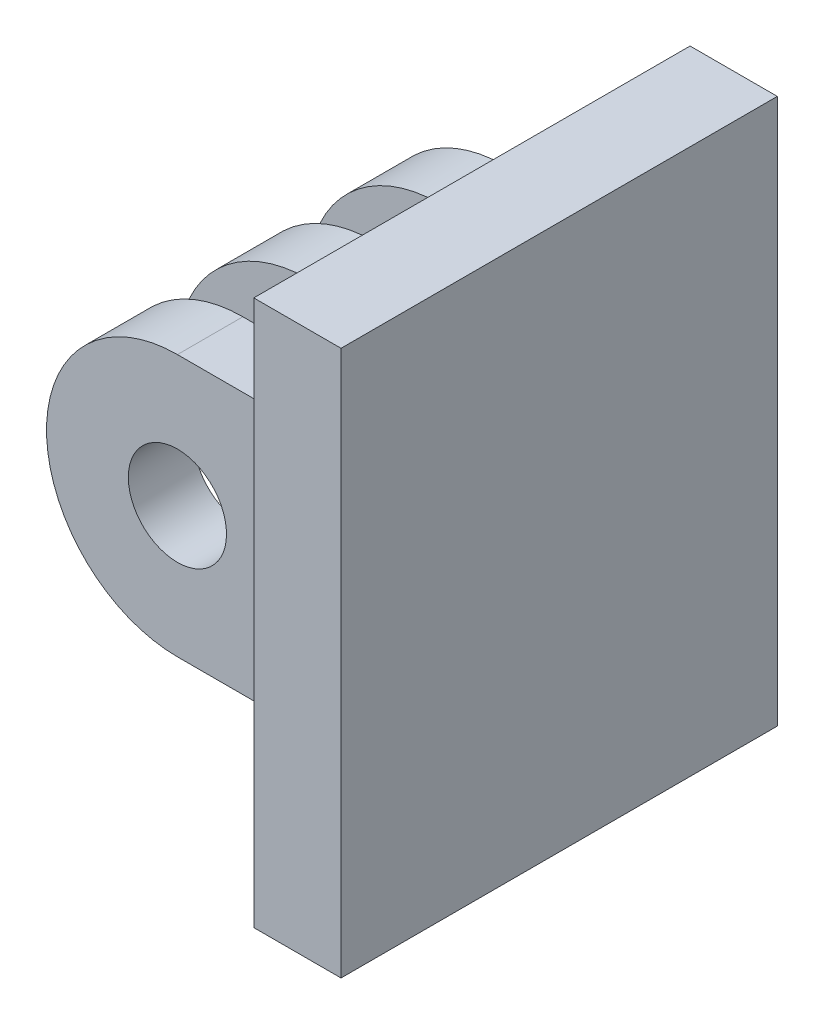
ISO-10303-21;
HEADER;
FILE_DESCRIPTION(('STEP AP214'),'2;1');
FILE_NAME('part.step','',(''),(''),'','','');
FILE_SCHEMA(('AUTOMOTIVE_DESIGN { 1 0 10303 214 1 1 1 1 }'));
ENDSEC;
DATA;
#1=APPLICATION_CONTEXT('core data for automotive mechanical design processes');
#2=APPLICATION_PROTOCOL_DEFINITION('international standard','automotive_design',2000,#1);
#3=PRODUCT_CONTEXT('',#1,'mechanical');
#4=PRODUCT('Part','Part','',(#3));
#5=PRODUCT_RELATED_PRODUCT_CATEGORY('part','',(#4));
#6=PRODUCT_DEFINITION_FORMATION('','',#4);
#7=PRODUCT_DEFINITION_CONTEXT('part definition',#1,'design');
#8=PRODUCT_DEFINITION('design','',#6,#7);
#9=PRODUCT_DEFINITION_SHAPE('','',#8);
#10=(LENGTH_UNIT() NAMED_UNIT(*) SI_UNIT(.MILLI.,.METRE.));
#11=(NAMED_UNIT(*) PLANE_ANGLE_UNIT() SI_UNIT($,.RADIAN.));
#12=(NAMED_UNIT(*) SI_UNIT($,.STERADIAN.) SOLID_ANGLE_UNIT());
#13=UNCERTAINTY_MEASURE_WITH_UNIT(LENGTH_MEASURE(1.E-05),#10,'distance_accuracy_value','');
#14=(GEOMETRIC_REPRESENTATION_CONTEXT(3) GLOBAL_UNCERTAINTY_ASSIGNED_CONTEXT((#13)) GLOBAL_UNIT_ASSIGNED_CONTEXT((#10,
#11,#12)) REPRESENTATION_CONTEXT('',''));
#15=CARTESIAN_POINT('',(0.,0.,0.));
#16=DIRECTION('',(0.,0.,1.));
#17=DIRECTION('',(1.,0.,0.));
#18=AXIS2_PLACEMENT_3D('',#15,#16,#17);
#19=CARTESIAN_POINT('',(-12.,-18.5,-11.5));
#20=DIRECTION('',(0.,0.,1.));
#21=DIRECTION('',(1.,0.,0.));
#22=AXIS2_PLACEMENT_3D('',#19,#20,#21);
#23=PLANE('',#22);
#24=CARTESIAN_POINT('',(-6.,-12.5,-11.5));
#25=DIRECTION('',(0.,0.,1.));
#26=DIRECTION('',(1.,0.,0.));
#27=AXIS2_PLACEMENT_3D('',#24,#25,#26);
#28=CIRCLE('',#27,2.25);
#29=CARTESIAN_POINT('',(-3.75,-12.5,-11.5));
#30=VERTEX_POINT('',#29);
#31=EDGE_CURVE('E345',#30,#30,#28,.T.);
#32=ORIENTED_EDGE('',*,*,#31,.T.);
#33=EDGE_LOOP('',(#32));
#34=FACE_BOUND('',#33,.T.);
#35=DIRECTION('',(1.,0.,0.));
#36=VECTOR('',#35,1.);
#37=CARTESIAN_POINT('',(-12.,-18.5,-11.5));
#38=LINE('',#37,#36);
#39=CARTESIAN_POINT('',(-6.,-18.5,-11.5));
#40=VERTEX_POINT('',#39);
#41=CARTESIAN_POINT('',(0.,-18.5,-11.5));
#42=VERTEX_POINT('',#41);
#43=EDGE_CURVE('E237',#40,#42,#38,.T.);
#44=ORIENTED_EDGE('',*,*,#43,.F.);
#45=CARTESIAN_POINT('',(-6.,-12.5,-11.5));
#46=DIRECTION('',(0.,0.,1.));
#47=DIRECTION('',(1.,0.,0.));
#48=AXIS2_PLACEMENT_3D('',#45,#46,#47);
#49=CIRCLE('',#48,6.);
#50=CARTESIAN_POINT('',(-6.,-6.50000000000001,-11.5));
#51=VERTEX_POINT('',#50);
#52=EDGE_CURVE('E363',#40,#51,#49,.F.);
#53=ORIENTED_EDGE('',*,*,#52,.T.);
#54=DIRECTION('',(1.,0.,0.));
#55=VECTOR('',#54,1.);
#56=CARTESIAN_POINT('',(-12.,-6.5,-11.5));
#57=LINE('',#56,#55);
#58=CARTESIAN_POINT('',(0.,-6.5,-11.5));
#59=VERTEX_POINT('',#58);
#60=EDGE_CURVE('E231',#51,#59,#57,.T.);
#61=ORIENTED_EDGE('',*,*,#60,.T.);
#62=DIRECTION('',(0.,-1.,0.));
#63=VECTOR('',#62,1.);
#64=CARTESIAN_POINT('',(0.,-18.5,-11.5));
#65=LINE('',#64,#63);
#66=EDGE_CURVE('E219',#59,#42,#65,.T.);
#67=ORIENTED_EDGE('',*,*,#66,.T.);
#68=EDGE_LOOP('',(#44,#53,#61,#67));
#69=FACE_BOUND('',#68,.T.);
#70=ADVANCED_FACE('F57',(#34,#69),#23,.F.);
#71=CARTESIAN_POINT('',(-12.,-18.5,-8.50000000000001));
#72=DIRECTION('',(0.,1.,0.));
#73=DIRECTION('',(0.,0.,1.));
#74=AXIS2_PLACEMENT_3D('',#71,#72,#73);
#75=PLANE('',#74);
#76=DIRECTION('',(0.,0.,-1.));
#77=VECTOR('',#76,1.);
#78=CARTESIAN_POINT('',(-6.,-18.5,0.));
#79=LINE('',#78,#77);
#80=CARTESIAN_POINT('',(-6.,-18.5,-8.50000000000001));
#81=VERTEX_POINT('',#80);
#82=EDGE_CURVE('E188',#81,#40,#79,.T.);
#83=ORIENTED_EDGE('',*,*,#82,.T.);
#84=ORIENTED_EDGE('',*,*,#43,.T.);
#85=DIRECTION('',(0.,0.,1.));
#86=VECTOR('',#85,1.);
#87=CARTESIAN_POINT('',(0.,-18.5,-8.50000000000001));
#88=LINE('',#87,#86);
#89=CARTESIAN_POINT('',(0.,-18.5,-8.50000000000001));
#90=VERTEX_POINT('',#89);
#91=EDGE_CURVE('E222',#42,#90,#88,.T.);
#92=ORIENTED_EDGE('',*,*,#91,.T.);
#93=DIRECTION('',(1.,0.,0.));
#94=VECTOR('',#93,1.);
#95=CARTESIAN_POINT('',(-12.,-18.5,-8.50000000000001));
#96=LINE('',#95,#94);
#97=EDGE_CURVE('E235',#81,#90,#96,.T.);
#98=ORIENTED_EDGE('',*,*,#97,.F.);
#99=EDGE_LOOP('',(#83,#84,#92,#98));
#100=FACE_BOUND('',#99,.T.);
#101=ADVANCED_FACE('F286',(#100),#75,.F.);
#102=CARTESIAN_POINT('',(-12.,-18.5,-8.50000000000001));
#103=DIRECTION('',(0.,0.,-1.));
#104=DIRECTION('',(-1.,0.,0.));
#105=AXIS2_PLACEMENT_3D('',#102,#103,#104);
#106=PLANE('',#105);
#107=CARTESIAN_POINT('',(-6.,-12.5,-8.50000000000001));
#108=DIRECTION('',(0.,0.,-1.));
#109=DIRECTION('',(-1.,0.,0.));
#110=AXIS2_PLACEMENT_3D('',#107,#108,#109);
#111=CIRCLE('',#110,2.25);
#112=CARTESIAN_POINT('',(-8.25,-12.5,-8.50000000000001));
#113=VERTEX_POINT('',#112);
#114=EDGE_CURVE('E351',#113,#113,#111,.T.);
#115=ORIENTED_EDGE('',*,*,#114,.T.);
#116=EDGE_LOOP('',(#115));
#117=FACE_BOUND('',#116,.T.);
#118=CARTESIAN_POINT('',(-6.,-12.5,-8.50000000000001));
#119=DIRECTION('',(0.,0.,-1.));
#120=DIRECTION('',(-1.,0.,0.));
#121=AXIS2_PLACEMENT_3D('',#118,#119,#120);
#122=CIRCLE('',#121,6.);
#123=CARTESIAN_POINT('',(-6.,-6.50000000000001,-8.50000000000001));
#124=VERTEX_POINT('',#123);
#125=EDGE_CURVE('E366',#124,#81,#122,.F.);
#126=ORIENTED_EDGE('',*,*,#125,.T.);
#127=ORIENTED_EDGE('',*,*,#97,.T.);
#128=DIRECTION('',(0.,1.,0.));
#129=VECTOR('',#128,1.);
#130=CARTESIAN_POINT('',(0.,-18.5,-8.50000000000001));
#131=LINE('',#130,#129);
#132=CARTESIAN_POINT('',(0.,-6.5,-8.50000000000001));
#133=VERTEX_POINT('',#132);
#134=EDGE_CURVE('E225',#90,#133,#131,.T.);
#135=ORIENTED_EDGE('',*,*,#134,.T.);
#136=DIRECTION('',(1.,0.,0.));
#137=VECTOR('',#136,1.);
#138=CARTESIAN_POINT('',(-12.,-6.5,-8.50000000000001));
#139=LINE('',#138,#137);
#140=EDGE_CURVE('E233',#124,#133,#139,.T.);
#141=ORIENTED_EDGE('',*,*,#140,.F.);
#142=EDGE_LOOP('',(#126,#127,#135,#141));
#143=FACE_BOUND('',#142,.T.);
#144=ADVANCED_FACE('F292',(#117,#143),#106,.F.);
#145=CARTESIAN_POINT('',(-12.,-6.5,-2.5));
#146=DIRECTION('',(0.,0.,-1.));
#147=DIRECTION('',(0.,1.,0.));
#148=AXIS2_PLACEMENT_3D('',#145,#146,#147);
#149=PLANE('',#148);
#150=CARTESIAN_POINT('',(-6.,-12.5,-2.5));
#151=DIRECTION('',(0.,0.,-1.));
#152=DIRECTION('',(0.,1.,0.));
#153=AXIS2_PLACEMENT_3D('',#150,#151,#152);
#154=CIRCLE('',#153,2.25);
#155=CARTESIAN_POINT('',(-6.,-10.25,-2.5));
#156=VERTEX_POINT('',#155);
#157=EDGE_CURVE('E354',#156,#156,#154,.T.);
#158=ORIENTED_EDGE('',*,*,#157,.T.);
#159=EDGE_LOOP('',(#158));
#160=FACE_BOUND('',#159,.T.);
#161=CARTESIAN_POINT('',(-6.,-12.5,-2.5));
#162=DIRECTION('',(0.,0.,-1.));
#163=DIRECTION('',(0.,1.,0.));
#164=AXIS2_PLACEMENT_3D('',#161,#162,#163);
#165=CIRCLE('',#164,6.);
#166=CARTESIAN_POINT('',(-6.,-6.50000000000001,-2.5));
#167=VERTEX_POINT('',#166);
#168=CARTESIAN_POINT('',(-6.,-18.5,-2.5));
#169=VERTEX_POINT('',#168);
#170=EDGE_CURVE('E368',#167,#169,#165,.F.);
#171=ORIENTED_EDGE('',*,*,#170,.T.);
#172=DIRECTION('',(1.,0.,0.));
#173=VECTOR('',#172,1.);
#174=CARTESIAN_POINT('',(-12.,-18.5,-2.5));
#175=LINE('',#174,#173);
#176=CARTESIAN_POINT('',(0.,-18.5,-2.5));
#177=VERTEX_POINT('',#176);
#178=EDGE_CURVE('E211',#169,#177,#175,.T.);
#179=ORIENTED_EDGE('',*,*,#178,.T.);
#180=DIRECTION('',(0.,1.,0.));
#181=VECTOR('',#180,1.);
#182=CARTESIAN_POINT('',(0.,-6.5,-2.5));
#183=LINE('',#182,#181);
#184=CARTESIAN_POINT('',(0.,-6.5,-2.5));
#185=VERTEX_POINT('',#184);
#186=EDGE_CURVE('E199',#177,#185,#183,.T.);
#187=ORIENTED_EDGE('',*,*,#186,.T.);
#188=DIRECTION('',(1.,0.,0.));
#189=VECTOR('',#188,1.);
#190=CARTESIAN_POINT('',(-12.,-6.5,-2.5));
#191=LINE('',#190,#189);
#192=EDGE_CURVE('E217',#167,#185,#191,.T.);
#193=ORIENTED_EDGE('',*,*,#192,.F.);
#194=EDGE_LOOP('',(#171,#179,#187,#193));
#195=FACE_BOUND('',#194,.T.);
#196=ADVANCED_FACE('F394',(#160,#195),#149,.F.);
#197=CARTESIAN_POINT('',(-12.,-6.5,-5.5));
#198=DIRECTION('',(0.,0.,1.));
#199=DIRECTION('',(0.,-1.,0.));
#200=AXIS2_PLACEMENT_3D('',#197,#198,#199);
#201=PLANE('',#200);
#202=CARTESIAN_POINT('',(-6.,-12.5,-5.5));
#203=DIRECTION('',(0.,0.,1.));
#204=DIRECTION('',(0.,-1.,0.));
#205=AXIS2_PLACEMENT_3D('',#202,#203,#204);
#206=CIRCLE('',#205,2.25);
#207=CARTESIAN_POINT('',(-6.,-14.75,-5.5));
#208=VERTEX_POINT('',#207);
#209=EDGE_CURVE('E357',#208,#208,#206,.T.);
#210=ORIENTED_EDGE('',*,*,#209,.T.);
#211=EDGE_LOOP('',(#210));
#212=FACE_BOUND('',#211,.T.);
#213=DIRECTION('',(1.,0.,0.));
#214=VECTOR('',#213,1.);
#215=CARTESIAN_POINT('',(-12.,-18.5,-5.5));
#216=LINE('',#215,#214);
#217=CARTESIAN_POINT('',(-6.,-18.5,-5.5));
#218=VERTEX_POINT('',#217);
#219=CARTESIAN_POINT('',(0.,-18.5,-5.5));
#220=VERTEX_POINT('',#219);
#221=EDGE_CURVE('E213',#218,#220,#216,.T.);
#222=ORIENTED_EDGE('',*,*,#221,.F.);
#223=CARTESIAN_POINT('',(-6.,-12.5,-5.5));
#224=DIRECTION('',(0.,0.,1.));
#225=DIRECTION('',(0.,-1.,0.));
#226=AXIS2_PLACEMENT_3D('',#223,#224,#225);
#227=CIRCLE('',#226,6.);
#228=CARTESIAN_POINT('',(-6.,-6.50000000000001,-5.5));
#229=VERTEX_POINT('',#228);
#230=EDGE_CURVE('E370',#218,#229,#227,.F.);
#231=ORIENTED_EDGE('',*,*,#230,.T.);
#232=DIRECTION('',(1.,0.,0.));
#233=VECTOR('',#232,1.);
#234=CARTESIAN_POINT('',(-12.,-6.5,-5.5));
#235=LINE('',#234,#233);
#236=CARTESIAN_POINT('',(0.,-6.5,-5.5));
#237=VERTEX_POINT('',#236);
#238=EDGE_CURVE('E215',#229,#237,#235,.T.);
#239=ORIENTED_EDGE('',*,*,#238,.T.);
#240=DIRECTION('',(0.,-1.,0.));
#241=VECTOR('',#240,1.);
#242=CARTESIAN_POINT('',(0.,-6.5,-5.5));
#243=LINE('',#242,#241);
#244=EDGE_CURVE('E205',#237,#220,#243,.T.);
#245=ORIENTED_EDGE('',*,*,#244,.T.);
#246=EDGE_LOOP('',(#222,#231,#239,#245));
#247=FACE_BOUND('',#246,.T.);
#248=ADVANCED_FACE('F387',(#212,#247),#201,.F.);
#249=CARTESIAN_POINT('',(-12.,-18.5,-5.5));
#250=DIRECTION('',(0.,1.,0.));
#251=DIRECTION('',(0.,0.,1.));
#252=AXIS2_PLACEMENT_3D('',#249,#250,#251);
#253=PLANE('',#252);
#254=EDGE_CURVE('E180',#169,#218,#79,.T.);
#255=ORIENTED_EDGE('',*,*,#254,.T.);
#256=ORIENTED_EDGE('',*,*,#221,.T.);
#257=DIRECTION('',(0.,0.,1.));
#258=VECTOR('',#257,1.);
#259=CARTESIAN_POINT('',(0.,-18.5,-5.5));
#260=LINE('',#259,#258);
#261=EDGE_CURVE('E208',#220,#177,#260,.T.);
#262=ORIENTED_EDGE('',*,*,#261,.T.);
#263=ORIENTED_EDGE('',*,*,#178,.F.);
#264=EDGE_LOOP('',(#255,#256,#262,#263));
#265=FACE_BOUND('',#264,.T.);
#266=ADVANCED_FACE('F397',(#265),#253,.F.);
#267=CARTESIAN_POINT('',(-12.,-6.50000000000001,-14.5));
#268=DIRECTION('',(0.,0.,-1.));
#269=DIRECTION('',(0.,1.,0.));
#270=AXIS2_PLACEMENT_3D('',#267,#268,#269);
#271=PLANE('',#270);
#272=CARTESIAN_POINT('',(-6.,-12.5,-14.5));
#273=DIRECTION('',(0.,0.,-1.));
#274=DIRECTION('',(0.,1.,0.));
#275=AXIS2_PLACEMENT_3D('',#272,#273,#274);
#276=CIRCLE('',#275,2.25);
#277=CARTESIAN_POINT('',(-6.,-10.25,-14.5));
#278=VERTEX_POINT('',#277);
#279=EDGE_CURVE('E360',#278,#278,#276,.T.);
#280=ORIENTED_EDGE('',*,*,#279,.T.);
#281=EDGE_LOOP('',(#280));
#282=FACE_BOUND('',#281,.T.);
#283=CARTESIAN_POINT('',(-6.,-12.5,-14.5));
#284=DIRECTION('',(0.,0.,-1.));
#285=DIRECTION('',(0.,1.,0.));
#286=AXIS2_PLACEMENT_3D('',#283,#284,#285);
#287=CIRCLE('',#286,6.);
#288=CARTESIAN_POINT('',(-6.,-6.50000000000001,-14.5));
#289=VERTEX_POINT('',#288);
#290=CARTESIAN_POINT('',(-6.,-18.5,-14.5));
#291=VERTEX_POINT('',#290);
#292=EDGE_CURVE('E373',#289,#291,#287,.F.);
#293=ORIENTED_EDGE('',*,*,#292,.T.);
#294=DIRECTION('',(1.,0.,0.));
#295=VECTOR('',#294,1.);
#296=CARTESIAN_POINT('',(-12.,-18.5,-14.5));
#297=LINE('',#296,#295);
#298=CARTESIAN_POINT('',(0.,-18.5,-14.5));
#299=VERTEX_POINT('',#298);
#300=EDGE_CURVE('E187',#291,#299,#297,.T.);
#301=ORIENTED_EDGE('',*,*,#300,.T.);
#302=DIRECTION('',(0.,1.,0.));
#303=VECTOR('',#302,1.);
#304=CARTESIAN_POINT('',(0.,-6.50000000000001,-14.5));
#305=LINE('',#304,#303);
#306=CARTESIAN_POINT('',(0.,-6.50000000000001,-14.5));
#307=VERTEX_POINT('',#306);
#308=EDGE_CURVE('E342',#299,#307,#305,.T.);
#309=ORIENTED_EDGE('',*,*,#308,.T.);
#310=DIRECTION('',(1.,0.,0.));
#311=VECTOR('',#310,1.);
#312=CARTESIAN_POINT('',(-12.,-6.50000000000001,-14.5));
#313=LINE('',#312,#311);
#314=EDGE_CURVE('E72',#289,#307,#313,.T.);
#315=ORIENTED_EDGE('',*,*,#314,.F.);
#316=EDGE_LOOP('',(#293,#301,#309,#315));
#317=FACE_BOUND('',#316,.T.);
#318=ADVANCED_FACE('F431',(#282,#317),#271,.F.);
#319=CARTESIAN_POINT('',(-12.,-6.50000000000001,-17.5));
#320=DIRECTION('',(0.,0.,1.));
#321=DIRECTION('',(1.,0.,0.));
#322=AXIS2_PLACEMENT_3D('',#319,#320,#321);
#323=PLANE('',#322);
#324=CARTESIAN_POINT('',(-6.,-12.5,-17.5));
#325=DIRECTION('',(0.,0.,1.));
#326=DIRECTION('',(1.,0.,0.));
#327=AXIS2_PLACEMENT_3D('',#324,#325,#326);
#328=CIRCLE('',#327,3.);
#329=CARTESIAN_POINT('',(-3.,-12.5,-17.5));
#330=VERTEX_POINT('',#329);
#331=EDGE_CURVE('E12',#330,#330,#328,.T.);
#332=ORIENTED_EDGE('',*,*,#331,.T.);
#333=EDGE_LOOP('',(#332));
#334=FACE_BOUND('',#333,.T.);
#335=DIRECTION('',(1.,0.,0.));
#336=VECTOR('',#335,1.);
#337=CARTESIAN_POINT('',(-12.,-18.5,-17.5));
#338=LINE('',#337,#336);
#339=CARTESIAN_POINT('',(-6.,-18.5,-17.5));
#340=VERTEX_POINT('',#339);
#341=CARTESIAN_POINT('',(0.,-18.5,-17.5));
#342=VERTEX_POINT('',#341);
#343=EDGE_CURVE('E185',#340,#342,#338,.T.);
#344=ORIENTED_EDGE('',*,*,#343,.F.);
#345=CARTESIAN_POINT('',(-6.,-12.5,-17.5));
#346=DIRECTION('',(0.,0.,-1.));
#347=DIRECTION('',(-1.,0.,0.));
#348=AXIS2_PLACEMENT_3D('',#345,#346,#347);
#349=CIRCLE('',#348,6.);
#350=CARTESIAN_POINT('',(-6.,-6.50000000000001,-17.5));
#351=VERTEX_POINT('',#350);
#352=EDGE_CURVE('E173',#351,#340,#349,.F.);
#353=ORIENTED_EDGE('',*,*,#352,.F.);
#354=DIRECTION('',(1.,0.,0.));
#355=VECTOR('',#354,1.);
#356=CARTESIAN_POINT('',(-12.,-6.50000000000001,-17.5));
#357=LINE('',#356,#355);
#358=CARTESIAN_POINT('',(0.,-6.50000000000001,-17.5));
#359=VERTEX_POINT('',#358);
#360=EDGE_CURVE('E80',#351,#359,#357,.T.);
#361=ORIENTED_EDGE('',*,*,#360,.T.);
#362=DIRECTION('',(0.,-1.,0.));
#363=VECTOR('',#362,1.);
#364=CARTESIAN_POINT('',(0.,-6.50000000000001,-17.5));
#365=LINE('',#364,#363);
#366=EDGE_CURVE('E191',#359,#342,#365,.T.);
#367=ORIENTED_EDGE('',*,*,#366,.T.);
#368=EDGE_LOOP('',(#344,#353,#361,#367));
#369=FACE_BOUND('',#368,.T.);
#370=ADVANCED_FACE('F190',(#334,#369),#323,.F.);
#371=CARTESIAN_POINT('',(-12.,-18.5,-17.5));
#372=DIRECTION('',(0.,1.,0.));
#373=DIRECTION('',(0.,0.,1.));
#374=AXIS2_PLACEMENT_3D('',#371,#372,#373);
#375=PLANE('',#374);
#376=EDGE_CURVE('E176',#291,#340,#79,.T.);
#377=ORIENTED_EDGE('',*,*,#376,.T.);
#378=ORIENTED_EDGE('',*,*,#343,.T.);
#379=DIRECTION('',(0.,0.,1.));
#380=VECTOR('',#379,1.);
#381=CARTESIAN_POINT('',(0.,-18.5,-17.5));
#382=LINE('',#381,#380);
#383=EDGE_CURVE('E194',#342,#299,#382,.T.);
#384=ORIENTED_EDGE('',*,*,#383,.T.);
#385=ORIENTED_EDGE('',*,*,#300,.F.);
#386=EDGE_LOOP('',(#377,#378,#384,#385));
#387=FACE_BOUND('',#386,.T.);
#388=ADVANCED_FACE('F183',(#387),#375,.F.);
#389=CARTESIAN_POINT('',(0.,0.,0.));
#390=DIRECTION('',(1.,0.,0.));
#391=DIRECTION('',(0.,0.,-1.));
#392=AXIS2_PLACEMENT_3D('',#389,#390,#391);
#393=PLANE('',#392);
#394=ORIENTED_EDGE('',*,*,#186,.F.);
#395=ORIENTED_EDGE('',*,*,#261,.F.);
#396=ORIENTED_EDGE('',*,*,#244,.F.);
#397=DIRECTION('',(0.,0.,-1.));
#398=VECTOR('',#397,1.);
#399=CARTESIAN_POINT('',(0.,-6.5,-5.5));
#400=LINE('',#399,#398);
#401=EDGE_CURVE('E202',#185,#237,#400,.T.);
#402=ORIENTED_EDGE('',*,*,#401,.F.);
#403=EDGE_LOOP('',(#394,#395,#396,#402));
#404=FACE_BOUND('',#403,.T.);
#405=DIRECTION('',(0.,-1.,0.));
#406=VECTOR('',#405,1.);
#407=CARTESIAN_POINT('',(0.,0.,0.));
#408=LINE('',#407,#406);
#409=CARTESIAN_POINT('',(0.,0.,0.));
#410=VERTEX_POINT('',#409);
#411=CARTESIAN_POINT('',(0.,-25.,0.));
#412=VERTEX_POINT('',#411);
#413=EDGE_CURVE('E239',#410,#412,#408,.T.);
#414=ORIENTED_EDGE('',*,*,#413,.F.);
#415=DIRECTION('',(0.,0.,1.));
#416=VECTOR('',#415,1.);
#417=CARTESIAN_POINT('',(0.,0.,0.));
#418=LINE('',#417,#416);
#419=CARTESIAN_POINT('',(0.,0.,-20.));
#420=VERTEX_POINT('',#419);
#421=EDGE_CURVE('E244',#420,#410,#418,.T.);
#422=ORIENTED_EDGE('',*,*,#421,.F.);
#423=DIRECTION('',(0.,1.,0.));
#424=VECTOR('',#423,1.);
#425=CARTESIAN_POINT('',(0.,0.,-20.));
#426=LINE('',#425,#424);
#427=CARTESIAN_POINT('',(0.,-25.,-20.));
#428=VERTEX_POINT('',#427);
#429=EDGE_CURVE('E255',#428,#420,#426,.T.);
#430=ORIENTED_EDGE('',*,*,#429,.F.);
#431=DIRECTION('',(0.,0.,-1.));
#432=VECTOR('',#431,1.);
#433=CARTESIAN_POINT('',(0.,-25.,0.));
#434=LINE('',#433,#432);
#435=EDGE_CURVE('E253',#412,#428,#434,.T.);
#436=ORIENTED_EDGE('',*,*,#435,.F.);
#437=EDGE_LOOP('',(#414,#422,#430,#436));
#438=FACE_BOUND('',#437,.T.);
#439=ORIENTED_EDGE('',*,*,#66,.F.);
#440=DIRECTION('',(0.,0.,-1.));
#441=VECTOR('',#440,1.);
#442=CARTESIAN_POINT('',(0.,-6.5,-8.50000000000001));
#443=LINE('',#442,#441);
#444=EDGE_CURVE('E228',#133,#59,#443,.T.);
#445=ORIENTED_EDGE('',*,*,#444,.F.);
#446=ORIENTED_EDGE('',*,*,#134,.F.);
#447=ORIENTED_EDGE('',*,*,#91,.F.);
#448=EDGE_LOOP('',(#439,#445,#446,#447));
#449=FACE_BOUND('',#448,.T.);
#450=ORIENTED_EDGE('',*,*,#308,.F.);
#451=ORIENTED_EDGE('',*,*,#383,.F.);
#452=ORIENTED_EDGE('',*,*,#366,.F.);
#453=DIRECTION('',(0.,0.,-1.));
#454=VECTOR('',#453,1.);
#455=CARTESIAN_POINT('',(0.,-6.50000000000001,-17.5));
#456=LINE('',#455,#454);
#457=EDGE_CURVE('E343',#307,#359,#456,.T.);
#458=ORIENTED_EDGE('',*,*,#457,.F.);
#459=EDGE_LOOP('',(#450,#451,#452,#458));
#460=FACE_BOUND('',#459,.T.);
#461=ADVANCED_FACE('F305',(#404,#438,#449,#460),#393,.F.);
#462=CARTESIAN_POINT('',(4.,0.,0.));
#463=DIRECTION('',(0.,0.,-1.));
#464=DIRECTION('',(0.,1.,0.));
#465=AXIS2_PLACEMENT_3D('',#462,#463,#464);
#466=PLANE('',#465);
#467=ORIENTED_EDGE('',*,*,#413,.T.);
#468=DIRECTION('',(-1.,0.,0.));
#469=VECTOR('',#468,1.);
#470=CARTESIAN_POINT('',(4.,-25.,0.));
#471=LINE('',#470,#469);
#472=CARTESIAN_POINT('',(4.,-25.,0.));
#473=VERTEX_POINT('',#472);
#474=EDGE_CURVE('E266',#473,#412,#471,.T.);
#475=ORIENTED_EDGE('',*,*,#474,.F.);
#476=DIRECTION('',(0.,-1.,0.));
#477=VECTOR('',#476,1.);
#478=CARTESIAN_POINT('',(4.,0.,0.));
#479=LINE('',#478,#477);
#480=CARTESIAN_POINT('',(4.,0.,0.));
#481=VERTEX_POINT('',#480);
#482=EDGE_CURVE('E240',#481,#473,#479,.T.);
#483=ORIENTED_EDGE('',*,*,#482,.F.);
#484=DIRECTION('',(-1.,0.,0.));
#485=VECTOR('',#484,1.);
#486=CARTESIAN_POINT('',(4.,0.,0.));
#487=LINE('',#486,#485);
#488=EDGE_CURVE('E250',#481,#410,#487,.T.);
#489=ORIENTED_EDGE('',*,*,#488,.T.);
#490=EDGE_LOOP('',(#467,#475,#483,#489));
#491=FACE_BOUND('',#490,.T.);
#492=ADVANCED_FACE('F308',(#491),#466,.F.);
#493=CARTESIAN_POINT('',(4.,-25.,0.));
#494=DIRECTION('',(0.,1.,0.));
#495=DIRECTION('',(0.,0.,1.));
#496=AXIS2_PLACEMENT_3D('',#493,#494,#495);
#497=PLANE('',#496);
#498=ORIENTED_EDGE('',*,*,#435,.T.);
#499=DIRECTION('',(-1.,0.,0.));
#500=VECTOR('',#499,1.);
#501=CARTESIAN_POINT('',(4.,-25.,-20.));
#502=LINE('',#501,#500);
#503=CARTESIAN_POINT('',(4.,-25.,-20.));
#504=VERTEX_POINT('',#503);
#505=EDGE_CURVE('E263',#504,#428,#502,.T.);
#506=ORIENTED_EDGE('',*,*,#505,.F.);
#507=DIRECTION('',(0.,0.,-1.));
#508=VECTOR('',#507,1.);
#509=CARTESIAN_POINT('',(4.,-25.,0.));
#510=LINE('',#509,#508);
#511=EDGE_CURVE('E243',#473,#504,#510,.T.);
#512=ORIENTED_EDGE('',*,*,#511,.F.);
#513=ORIENTED_EDGE('',*,*,#474,.T.);
#514=EDGE_LOOP('',(#498,#506,#512,#513));
#515=FACE_BOUND('',#514,.T.);
#516=ADVANCED_FACE('F316',(#515),#497,.F.);
#517=CARTESIAN_POINT('',(4.,0.,-20.));
#518=DIRECTION('',(0.,0.,1.));
#519=DIRECTION('',(0.,-1.,0.));
#520=AXIS2_PLACEMENT_3D('',#517,#518,#519);
#521=PLANE('',#520);
#522=ORIENTED_EDGE('',*,*,#429,.T.);
#523=DIRECTION('',(-1.,0.,0.));
#524=VECTOR('',#523,1.);
#525=CARTESIAN_POINT('',(4.,0.,-20.));
#526=LINE('',#525,#524);
#527=CARTESIAN_POINT('',(4.,0.,-20.));
#528=VERTEX_POINT('',#527);
#529=EDGE_CURVE('E260',#528,#420,#526,.T.);
#530=ORIENTED_EDGE('',*,*,#529,.F.);
#531=DIRECTION('',(0.,1.,0.));
#532=VECTOR('',#531,1.);
#533=CARTESIAN_POINT('',(4.,0.,-20.));
#534=LINE('',#533,#532);
#535=EDGE_CURVE('E246',#504,#528,#534,.T.);
#536=ORIENTED_EDGE('',*,*,#535,.F.);
#537=ORIENTED_EDGE('',*,*,#505,.T.);
#538=EDGE_LOOP('',(#522,#530,#536,#537));
#539=FACE_BOUND('',#538,.T.);
#540=ADVANCED_FACE('F312',(#539),#521,.F.);
#541=CARTESIAN_POINT('',(4.,0.,0.));
#542=DIRECTION('',(0.,-1.,0.));
#543=DIRECTION('',(0.,0.,-1.));
#544=AXIS2_PLACEMENT_3D('',#541,#542,#543);
#545=PLANE('',#544);
#546=ORIENTED_EDGE('',*,*,#421,.T.);
#547=ORIENTED_EDGE('',*,*,#488,.F.);
#548=DIRECTION('',(0.,0.,1.));
#549=VECTOR('',#548,1.);
#550=CARTESIAN_POINT('',(4.,0.,0.));
#551=LINE('',#550,#549);
#552=EDGE_CURVE('E248',#528,#481,#551,.T.);
#553=ORIENTED_EDGE('',*,*,#552,.F.);
#554=ORIENTED_EDGE('',*,*,#529,.T.);
#555=EDGE_LOOP('',(#546,#547,#553,#554));
#556=FACE_BOUND('',#555,.T.);
#557=ADVANCED_FACE('F303',(#556),#545,.F.);
#558=CARTESIAN_POINT('',(4.,0.,0.));
#559=DIRECTION('',(1.,0.,0.));
#560=DIRECTION('',(0.,0.,-1.));
#561=AXIS2_PLACEMENT_3D('',#558,#559,#560);
#562=PLANE('',#561);
#563=ORIENTED_EDGE('',*,*,#482,.T.);
#564=ORIENTED_EDGE('',*,*,#511,.T.);
#565=ORIENTED_EDGE('',*,*,#535,.T.);
#566=ORIENTED_EDGE('',*,*,#552,.T.);
#567=EDGE_LOOP('',(#563,#564,#565,#566));
#568=FACE_BOUND('',#567,.T.);
#569=ADVANCED_FACE('F299',(#568),#562,.T.);
#570=CARTESIAN_POINT('',(-12.,-6.5,-8.50000000000001));
#571=DIRECTION('',(0.,-1.,0.));
#572=DIRECTION('',(0.,0.,-1.));
#573=AXIS2_PLACEMENT_3D('',#570,#571,#572);
#574=PLANE('',#573);
#575=ORIENTED_EDGE('',*,*,#60,.F.);
#576=DIRECTION('',(0.,0.,-1.));
#577=VECTOR('',#576,1.);
#578=CARTESIAN_POINT('',(-6.,-6.50000000000001,0.));
#579=LINE('',#578,#577);
#580=EDGE_CURVE('E376',#124,#51,#579,.T.);
#581=ORIENTED_EDGE('',*,*,#580,.F.);
#582=ORIENTED_EDGE('',*,*,#140,.T.);
#583=ORIENTED_EDGE('',*,*,#444,.T.);
#584=EDGE_LOOP('',(#575,#581,#582,#583));
#585=FACE_BOUND('',#584,.T.);
#586=ADVANCED_FACE('F302',(#585),#574,.F.);
#587=CARTESIAN_POINT('',(-12.,-6.5,-5.5));
#588=DIRECTION('',(0.,-1.,0.));
#589=DIRECTION('',(0.,0.,-1.));
#590=AXIS2_PLACEMENT_3D('',#587,#588,#589);
#591=PLANE('',#590);
#592=ORIENTED_EDGE('',*,*,#238,.F.);
#593=EDGE_CURVE('E375',#167,#229,#579,.T.);
#594=ORIENTED_EDGE('',*,*,#593,.F.);
#595=ORIENTED_EDGE('',*,*,#192,.T.);
#596=ORIENTED_EDGE('',*,*,#401,.T.);
#597=EDGE_LOOP('',(#592,#594,#595,#596));
#598=FACE_BOUND('',#597,.T.);
#599=ADVANCED_FACE('F389',(#598),#591,.F.);
#600=CARTESIAN_POINT('',(-12.,-6.50000000000001,-17.5));
#601=DIRECTION('',(0.,-1.,0.));
#602=DIRECTION('',(0.,0.,-1.));
#603=AXIS2_PLACEMENT_3D('',#600,#601,#602);
#604=PLANE('',#603);
#605=ORIENTED_EDGE('',*,*,#360,.F.);
#606=EDGE_CURVE('E178',#289,#351,#579,.T.);
#607=ORIENTED_EDGE('',*,*,#606,.F.);
#608=ORIENTED_EDGE('',*,*,#314,.T.);
#609=ORIENTED_EDGE('',*,*,#457,.T.);
#610=EDGE_LOOP('',(#605,#607,#608,#609));
#611=FACE_BOUND('',#610,.T.);
#612=ADVANCED_FACE('F417',(#611),#604,.F.);
#613=CARTESIAN_POINT('',(-6.,-12.5,0.));
#614=DIRECTION('',(0.,0.,-1.));
#615=DIRECTION('',(-1.,0.,0.));
#616=AXIS2_PLACEMENT_3D('',#613,#614,#615);
#617=CYLINDRICAL_SURFACE('',#616,6.);
#618=ORIENTED_EDGE('',*,*,#606,.T.);
#619=ORIENTED_EDGE('',*,*,#352,.T.);
#620=ORIENTED_EDGE('',*,*,#376,.F.);
#621=ORIENTED_EDGE('',*,*,#292,.F.);
#622=EDGE_LOOP('',(#618,#619,#620,#621));
#623=FACE_BOUND('',#622,.T.);
#624=ADVANCED_FACE('F175',(#623),#617,.T.);
#625=CARTESIAN_POINT('',(-6.,-12.5,0.));
#626=DIRECTION('',(0.,0.,-1.));
#627=DIRECTION('',(-1.,0.,0.));
#628=AXIS2_PLACEMENT_3D('',#625,#626,#627);
#629=CYLINDRICAL_SURFACE('',#628,2.25);
#630=CARTESIAN_POINT('',(-6.,-12.5,-16.75));
#631=DIRECTION('',(0.,0.,1.));
#632=DIRECTION('',(1.,0.,0.));
#633=AXIS2_PLACEMENT_3D('',#630,#631,#632);
#634=CIRCLE('',#633,2.25);
#635=CARTESIAN_POINT('',(-3.75,-12.5,-16.75));
#636=VERTEX_POINT('',#635);
#637=EDGE_CURVE('E65',#636,#636,#634,.F.);
#638=ORIENTED_EDGE('',*,*,#637,.T.);
#639=EDGE_LOOP('',(#638));
#640=FACE_BOUND('',#639,.T.);
#641=ORIENTED_EDGE('',*,*,#279,.F.);
#642=EDGE_LOOP('',(#641));
#643=FACE_BOUND('',#642,.T.);
#644=ADVANCED_FACE('F271',(#640,#643),#629,.F.);
#645=ORIENTED_EDGE('',*,*,#593,.T.);
#646=ORIENTED_EDGE('',*,*,#230,.F.);
#647=ORIENTED_EDGE('',*,*,#254,.F.);
#648=ORIENTED_EDGE('',*,*,#170,.F.);
#649=EDGE_LOOP('',(#645,#646,#647,#648));
#650=FACE_BOUND('',#649,.T.);
#651=ADVANCED_FACE('F379',(#650),#617,.T.);
#652=ORIENTED_EDGE('',*,*,#209,.F.);
#653=EDGE_LOOP('',(#652));
#654=FACE_BOUND('',#653,.T.);
#655=ORIENTED_EDGE('',*,*,#157,.F.);
#656=EDGE_LOOP('',(#655));
#657=FACE_BOUND('',#656,.T.);
#658=ADVANCED_FACE('F283',(#654,#657),#629,.F.);
#659=ORIENTED_EDGE('',*,*,#52,.F.);
#660=ORIENTED_EDGE('',*,*,#82,.F.);
#661=ORIENTED_EDGE('',*,*,#125,.F.);
#662=ORIENTED_EDGE('',*,*,#580,.T.);
#663=EDGE_LOOP('',(#659,#660,#661,#662));
#664=FACE_BOUND('',#663,.T.);
#665=ADVANCED_FACE('F280',(#664),#617,.T.);
#666=ORIENTED_EDGE('',*,*,#114,.F.);
#667=EDGE_LOOP('',(#666));
#668=FACE_BOUND('',#667,.T.);
#669=ORIENTED_EDGE('',*,*,#31,.F.);
#670=EDGE_LOOP('',(#669));
#671=FACE_BOUND('',#670,.T.);
#672=ADVANCED_FACE('F275',(#668,#671),#629,.F.);
#673=CARTESIAN_POINT('',(-6.,-12.5,-16.75));
#674=DIRECTION('',(0.,0.,-1.));
#675=DIRECTION('',(-1.,0.,0.));
#676=AXIS2_PLACEMENT_3D('',#673,#674,#675);
#677=CONICAL_SURFACE('',#676,2.25,0.785398163397451);
#678=ORIENTED_EDGE('',*,*,#331,.F.);
#679=EDGE_LOOP('',(#678));
#680=FACE_BOUND('',#679,.T.);
#681=ORIENTED_EDGE('',*,*,#637,.F.);
#682=EDGE_LOOP('',(#681));
#683=FACE_BOUND('',#682,.T.);
#684=ADVANCED_FACE('F59',(#680,#683),#677,.F.);
#685=CLOSED_SHELL('',(#70,#101,#144,#196,#248,#266,#318,#370,#388,#461,#492,#516,#540,#557,#569,
#586,#599,#612,#624,#644,#651,#658,#665,#672,#684));
#686=MANIFOLD_SOLID_BREP('B2',#685);
#687=ADVANCED_BREP_SHAPE_REPRESENTATION('',(#18,#686),#14);
#688=SHAPE_DEFINITION_REPRESENTATION(#9,#687);
ENDSEC;
END-ISO-10303-21;
